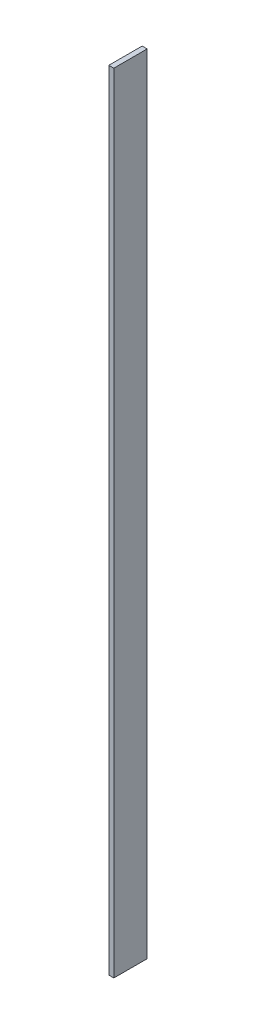
ISO-10303-21;
HEADER;
FILE_DESCRIPTION(('STEP AP214'),'2;1');
FILE_NAME('part.step','',(''),(''),'','','');
FILE_SCHEMA(('AUTOMOTIVE_DESIGN { 1 0 10303 214 1 1 1 1 }'));
ENDSEC;
DATA;
#1=APPLICATION_CONTEXT('core data for automotive mechanical design processes');
#2=APPLICATION_PROTOCOL_DEFINITION('international standard','automotive_design',2000,#1);
#3=PRODUCT_CONTEXT('',#1,'mechanical');
#4=PRODUCT('Part','Part','',(#3));
#5=PRODUCT_RELATED_PRODUCT_CATEGORY('part','',(#4));
#6=PRODUCT_DEFINITION_FORMATION('','',#4);
#7=PRODUCT_DEFINITION_CONTEXT('part definition',#1,'design');
#8=PRODUCT_DEFINITION('design','',#6,#7);
#9=PRODUCT_DEFINITION_SHAPE('','',#8);
#10=(LENGTH_UNIT() NAMED_UNIT(*) SI_UNIT(.MILLI.,.METRE.));
#11=(NAMED_UNIT(*) PLANE_ANGLE_UNIT() SI_UNIT($,.RADIAN.));
#12=(NAMED_UNIT(*) SI_UNIT($,.STERADIAN.) SOLID_ANGLE_UNIT());
#13=UNCERTAINTY_MEASURE_WITH_UNIT(LENGTH_MEASURE(1.E-05),#10,'distance_accuracy_value','');
#14=(GEOMETRIC_REPRESENTATION_CONTEXT(3) GLOBAL_UNCERTAINTY_ASSIGNED_CONTEXT((#13)) GLOBAL_UNIT_ASSIGNED_CONTEXT((#10,
#11,#12)) REPRESENTATION_CONTEXT('',''));
#15=CARTESIAN_POINT('',(0.,0.,0.));
#16=DIRECTION('',(0.,0.,1.));
#17=DIRECTION('',(1.,0.,0.));
#18=AXIS2_PLACEMENT_3D('',#15,#16,#17);
#19=CARTESIAN_POINT('',(2.38125,0.,0.));
#20=DIRECTION('',(0.,0.,-1.));
#21=DIRECTION('',(-1.,0.,0.));
#22=AXIS2_PLACEMENT_3D('',#19,#20,#21);
#23=PLANE('',#22);
#24=DIRECTION('',(0.,-1.,0.));
#25=VECTOR('',#24,1.);
#26=CARTESIAN_POINT('',(0.,0.,0.));
#27=LINE('',#26,#25);
#28=CARTESIAN_POINT('',(0.,374.65,0.));
#29=VERTEX_POINT('',#28);
#30=CARTESIAN_POINT('',(0.,0.,0.));
#31=VERTEX_POINT('',#30);
#32=EDGE_CURVE('E100',#29,#31,#27,.T.);
#33=ORIENTED_EDGE('',*,*,#32,.T.);
#34=DIRECTION('',(-1.,0.,0.));
#35=VECTOR('',#34,1.);
#36=CARTESIAN_POINT('',(2.38125,0.,0.));
#37=LINE('',#36,#35);
#38=CARTESIAN_POINT('',(2.38125,0.,0.));
#39=VERTEX_POINT('',#38);
#40=EDGE_CURVE('E11',#39,#31,#37,.T.);
#41=ORIENTED_EDGE('',*,*,#40,.F.);
#42=DIRECTION('',(0.,-1.,0.));
#43=VECTOR('',#42,1.);
#44=CARTESIAN_POINT('',(2.38125,0.,0.));
#45=LINE('',#44,#43);
#46=CARTESIAN_POINT('',(2.38125,374.65,0.));
#47=VERTEX_POINT('',#46);
#48=EDGE_CURVE('E88',#47,#39,#45,.T.);
#49=ORIENTED_EDGE('',*,*,#48,.F.);
#50=DIRECTION('',(-1.,0.,0.));
#51=VECTOR('',#50,1.);
#52=CARTESIAN_POINT('',(2.38125,374.65,0.));
#53=LINE('',#52,#51);
#54=EDGE_CURVE('E96',#47,#29,#53,.T.);
#55=ORIENTED_EDGE('',*,*,#54,.T.);
#56=EDGE_LOOP('',(#33,#41,#49,#55));
#57=FACE_BOUND('',#56,.T.);
#58=ADVANCED_FACE('F37',(#57),#23,.F.);
#59=CARTESIAN_POINT('',(2.38125,0.,0.));
#60=DIRECTION('',(0.,1.,0.));
#61=DIRECTION('',(0.,0.,1.));
#62=AXIS2_PLACEMENT_3D('',#59,#60,#61);
#63=PLANE('',#62);
#64=DIRECTION('',(0.,0.,-1.));
#65=VECTOR('',#64,1.);
#66=CARTESIAN_POINT('',(0.,0.,0.));
#67=LINE('',#66,#65);
#68=CARTESIAN_POINT('',(0.,0.,-15.875));
#69=VERTEX_POINT('',#68);
#70=EDGE_CURVE('E92',#31,#69,#67,.T.);
#71=ORIENTED_EDGE('',*,*,#70,.T.);
#72=DIRECTION('',(-1.,0.,0.));
#73=VECTOR('',#72,1.);
#74=CARTESIAN_POINT('',(2.38125,0.,-15.875));
#75=LINE('',#74,#73);
#76=CARTESIAN_POINT('',(2.38125,0.,-15.875));
#77=VERTEX_POINT('',#76);
#78=EDGE_CURVE('E45',#77,#69,#75,.T.);
#79=ORIENTED_EDGE('',*,*,#78,.F.);
#80=DIRECTION('',(0.,0.,-1.));
#81=VECTOR('',#80,1.);
#82=CARTESIAN_POINT('',(2.38125,0.,0.));
#83=LINE('',#82,#81);
#84=EDGE_CURVE('E83',#39,#77,#83,.T.);
#85=ORIENTED_EDGE('',*,*,#84,.F.);
#86=ORIENTED_EDGE('',*,*,#40,.T.);
#87=EDGE_LOOP('',(#71,#79,#85,#86));
#88=FACE_BOUND('',#87,.T.);
#89=ADVANCED_FACE('F91',(#88),#63,.F.);
#90=CARTESIAN_POINT('',(2.38125,0.,-15.875));
#91=DIRECTION('',(0.,0.,1.));
#92=DIRECTION('',(1.,0.,0.));
#93=AXIS2_PLACEMENT_3D('',#90,#91,#92);
#94=PLANE('',#93);
#95=DIRECTION('',(0.,1.,0.));
#96=VECTOR('',#95,1.);
#97=CARTESIAN_POINT('',(0.,0.,-15.875));
#98=LINE('',#97,#96);
#99=CARTESIAN_POINT('',(0.,374.65,-15.875));
#100=VERTEX_POINT('',#99);
#101=EDGE_CURVE('E70',#69,#100,#98,.T.);
#102=ORIENTED_EDGE('',*,*,#101,.T.);
#103=DIRECTION('',(-1.,0.,0.));
#104=VECTOR('',#103,1.);
#105=CARTESIAN_POINT('',(2.38125,374.65,-15.875));
#106=LINE('',#105,#104);
#107=CARTESIAN_POINT('',(2.38125,374.65,-15.875));
#108=VERTEX_POINT('',#107);
#109=EDGE_CURVE('E93',#108,#100,#106,.T.);
#110=ORIENTED_EDGE('',*,*,#109,.F.);
#111=DIRECTION('',(0.,1.,0.));
#112=VECTOR('',#111,1.);
#113=CARTESIAN_POINT('',(2.38125,0.,-15.875));
#114=LINE('',#113,#112);
#115=EDGE_CURVE('E86',#77,#108,#114,.T.);
#116=ORIENTED_EDGE('',*,*,#115,.F.);
#117=ORIENTED_EDGE('',*,*,#78,.T.);
#118=EDGE_LOOP('',(#102,#110,#116,#117));
#119=FACE_BOUND('',#118,.T.);
#120=ADVANCED_FACE('F94',(#119),#94,.F.);
#121=CARTESIAN_POINT('',(2.38125,374.65,0.));
#122=DIRECTION('',(0.,-1.,0.));
#123=DIRECTION('',(0.,0.,-1.));
#124=AXIS2_PLACEMENT_3D('',#121,#122,#123);
#125=PLANE('',#124);
#126=DIRECTION('',(0.,0.,1.));
#127=VECTOR('',#126,1.);
#128=CARTESIAN_POINT('',(0.,374.65,0.));
#129=LINE('',#128,#127);
#130=EDGE_CURVE('E76',#100,#29,#129,.T.);
#131=ORIENTED_EDGE('',*,*,#130,.T.);
#132=ORIENTED_EDGE('',*,*,#54,.F.);
#133=DIRECTION('',(0.,0.,1.));
#134=VECTOR('',#133,1.);
#135=CARTESIAN_POINT('',(2.38125,374.65,0.));
#136=LINE('',#135,#134);
#137=EDGE_CURVE('E53',#108,#47,#136,.T.);
#138=ORIENTED_EDGE('',*,*,#137,.F.);
#139=ORIENTED_EDGE('',*,*,#109,.T.);
#140=EDGE_LOOP('',(#131,#132,#138,#139));
#141=FACE_BOUND('',#140,.T.);
#142=ADVANCED_FACE('F107',(#141),#125,.F.);
#143=CARTESIAN_POINT('',(2.38125,0.,0.));
#144=DIRECTION('',(-1.,0.,0.));
#145=DIRECTION('',(0.,0.,1.));
#146=AXIS2_PLACEMENT_3D('',#143,#144,#145);
#147=PLANE('',#146);
#148=ORIENTED_EDGE('',*,*,#48,.T.);
#149=ORIENTED_EDGE('',*,*,#84,.T.);
#150=ORIENTED_EDGE('',*,*,#115,.T.);
#151=ORIENTED_EDGE('',*,*,#137,.T.);
#152=EDGE_LOOP('',(#148,#149,#150,#151));
#153=FACE_BOUND('',#152,.T.);
#154=ADVANCED_FACE('F84',(#153),#147,.F.);
#155=CARTESIAN_POINT('',(0.,0.,0.));
#156=DIRECTION('',(-1.,0.,0.));
#157=DIRECTION('',(0.,0.,1.));
#158=AXIS2_PLACEMENT_3D('',#155,#156,#157);
#159=PLANE('',#158);
#160=ORIENTED_EDGE('',*,*,#32,.F.);
#161=ORIENTED_EDGE('',*,*,#130,.F.);
#162=ORIENTED_EDGE('',*,*,#101,.F.);
#163=ORIENTED_EDGE('',*,*,#70,.F.);
#164=EDGE_LOOP('',(#160,#161,#162,#163));
#165=FACE_BOUND('',#164,.T.);
#166=ADVANCED_FACE('F110',(#165),#159,.T.);
#167=CLOSED_SHELL('',(#58,#89,#120,#142,#154,#166));
#168=MANIFOLD_SOLID_BREP('B2',#167);
#169=ADVANCED_BREP_SHAPE_REPRESENTATION('',(#18,#168),#14);
#170=SHAPE_DEFINITION_REPRESENTATION(#9,#169);
ENDSEC;
END-ISO-10303-21;
